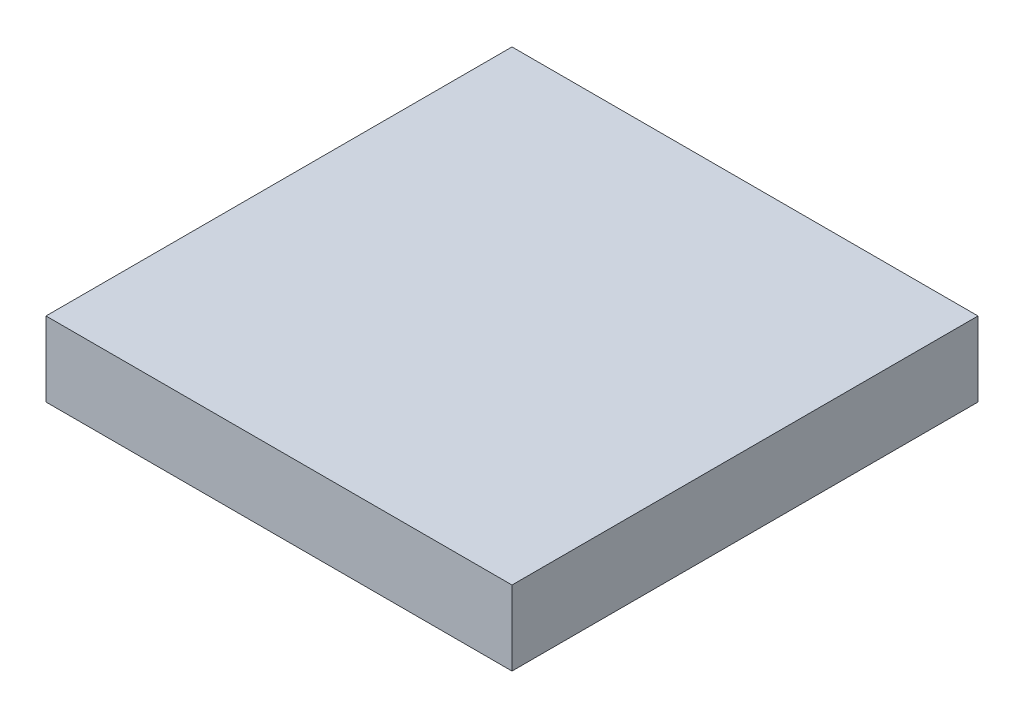
ISO-10303-21;
HEADER;
FILE_DESCRIPTION(('STEP AP214'),'2;1');
FILE_NAME('part.step','',(''),(''),'','','');
FILE_SCHEMA(('AUTOMOTIVE_DESIGN { 1 0 10303 214 1 1 1 1 }'));
ENDSEC;
DATA;
#1=APPLICATION_CONTEXT('core data for automotive mechanical design processes');
#2=APPLICATION_PROTOCOL_DEFINITION('international standard','automotive_design',2000,#1);
#3=PRODUCT_CONTEXT('',#1,'mechanical');
#4=PRODUCT('Part','Part','',(#3));
#5=PRODUCT_RELATED_PRODUCT_CATEGORY('part','',(#4));
#6=PRODUCT_DEFINITION_FORMATION('','',#4);
#7=PRODUCT_DEFINITION_CONTEXT('part definition',#1,'design');
#8=PRODUCT_DEFINITION('design','',#6,#7);
#9=PRODUCT_DEFINITION_SHAPE('','',#8);
#10=(LENGTH_UNIT() NAMED_UNIT(*) SI_UNIT(.MILLI.,.METRE.));
#11=(NAMED_UNIT(*) PLANE_ANGLE_UNIT() SI_UNIT($,.RADIAN.));
#12=(NAMED_UNIT(*) SI_UNIT($,.STERADIAN.) SOLID_ANGLE_UNIT());
#13=UNCERTAINTY_MEASURE_WITH_UNIT(LENGTH_MEASURE(1.E-05),#10,'distance_accuracy_value','');
#14=(GEOMETRIC_REPRESENTATION_CONTEXT(3) GLOBAL_UNCERTAINTY_ASSIGNED_CONTEXT((#13)) GLOBAL_UNIT_ASSIGNED_CONTEXT((#10,
#11,#12)) REPRESENTATION_CONTEXT('',''));
#15=CARTESIAN_POINT('',(0.,0.,0.));
#16=DIRECTION('',(0.,0.,1.));
#17=DIRECTION('',(1.,0.,0.));
#18=AXIS2_PLACEMENT_3D('',#15,#16,#17);
#19=CARTESIAN_POINT('',(-1.25,0.4,-1.25));
#20=DIRECTION('',(1.,0.,0.));
#21=DIRECTION('',(0.,0.,-1.));
#22=AXIS2_PLACEMENT_3D('',#19,#20,#21);
#23=PLANE('',#22);
#24=DIRECTION('',(0.,0.,1.));
#25=VECTOR('',#24,1.);
#26=CARTESIAN_POINT('',(-1.25,0.,-1.25));
#27=LINE('',#26,#25);
#28=CARTESIAN_POINT('',(-1.25,0.,-1.25));
#29=VERTEX_POINT('',#28);
#30=CARTESIAN_POINT('',(-1.25,0.,1.25));
#31=VERTEX_POINT('',#30);
#32=EDGE_CURVE('E111',#29,#31,#27,.T.);
#33=ORIENTED_EDGE('',*,*,#32,.T.);
#34=DIRECTION('',(0.,-1.,0.));
#35=VECTOR('',#34,1.);
#36=CARTESIAN_POINT('',(-1.25,0.4,1.25));
#37=LINE('',#36,#35);
#38=CARTESIAN_POINT('',(-1.25,0.4,1.25));
#39=VERTEX_POINT('',#38);
#40=EDGE_CURVE('E11',#39,#31,#37,.T.);
#41=ORIENTED_EDGE('',*,*,#40,.F.);
#42=DIRECTION('',(0.,0.,1.));
#43=VECTOR('',#42,1.);
#44=CARTESIAN_POINT('',(-1.25,0.4,-1.25));
#45=LINE('',#44,#43);
#46=CARTESIAN_POINT('',(-1.25,0.4,-1.25));
#47=VERTEX_POINT('',#46);
#48=EDGE_CURVE('E93',#47,#39,#45,.T.);
#49=ORIENTED_EDGE('',*,*,#48,.F.);
#50=DIRECTION('',(0.,-1.,0.));
#51=VECTOR('',#50,1.);
#52=CARTESIAN_POINT('',(-1.25,0.4,-1.25));
#53=LINE('',#52,#51);
#54=EDGE_CURVE('E107',#47,#29,#53,.T.);
#55=ORIENTED_EDGE('',*,*,#54,.T.);
#56=EDGE_LOOP('',(#33,#41,#49,#55));
#57=FACE_BOUND('',#56,.T.);
#58=ADVANCED_FACE('F41',(#57),#23,.F.);
#59=CARTESIAN_POINT('',(-1.25,0.4,1.25));
#60=DIRECTION('',(0.,0.,-1.));
#61=DIRECTION('',(-1.,0.,0.));
#62=AXIS2_PLACEMENT_3D('',#59,#60,#61);
#63=PLANE('',#62);
#64=DIRECTION('',(1.,0.,0.));
#65=VECTOR('',#64,1.);
#66=CARTESIAN_POINT('',(-1.25,0.,1.25));
#67=LINE('',#66,#65);
#68=CARTESIAN_POINT('',(1.25,0.,1.25));
#69=VERTEX_POINT('',#68);
#70=EDGE_CURVE('E98',#31,#69,#67,.T.);
#71=ORIENTED_EDGE('',*,*,#70,.T.);
#72=DIRECTION('',(0.,-1.,0.));
#73=VECTOR('',#72,1.);
#74=CARTESIAN_POINT('',(1.25,0.4,1.25));
#75=LINE('',#74,#73);
#76=CARTESIAN_POINT('',(1.25,0.4,1.25));
#77=VERTEX_POINT('',#76);
#78=EDGE_CURVE('E50',#77,#69,#75,.T.);
#79=ORIENTED_EDGE('',*,*,#78,.F.);
#80=DIRECTION('',(1.,0.,0.));
#81=VECTOR('',#80,1.);
#82=CARTESIAN_POINT('',(-1.25,0.4,1.25));
#83=LINE('',#82,#81);
#84=EDGE_CURVE('E88',#39,#77,#83,.T.);
#85=ORIENTED_EDGE('',*,*,#84,.F.);
#86=ORIENTED_EDGE('',*,*,#40,.T.);
#87=EDGE_LOOP('',(#71,#79,#85,#86));
#88=FACE_BOUND('',#87,.T.);
#89=ADVANCED_FACE('F97',(#88),#63,.F.);
#90=CARTESIAN_POINT('',(1.25,0.4,-1.25));
#91=DIRECTION('',(-1.,0.,0.));
#92=DIRECTION('',(0.,0.,1.));
#93=AXIS2_PLACEMENT_3D('',#90,#91,#92);
#94=PLANE('',#93);
#95=DIRECTION('',(0.,0.,-1.));
#96=VECTOR('',#95,1.);
#97=CARTESIAN_POINT('',(1.25,0.,-1.25));
#98=LINE('',#97,#96);
#99=CARTESIAN_POINT('',(1.25,0.,-1.25));
#100=VERTEX_POINT('',#99);
#101=EDGE_CURVE('E75',#69,#100,#98,.T.);
#102=ORIENTED_EDGE('',*,*,#101,.T.);
#103=DIRECTION('',(0.,-1.,0.));
#104=VECTOR('',#103,1.);
#105=CARTESIAN_POINT('',(1.25,0.4,-1.25));
#106=LINE('',#105,#104);
#107=CARTESIAN_POINT('',(1.25,0.4,-1.25));
#108=VERTEX_POINT('',#107);
#109=EDGE_CURVE('E100',#108,#100,#106,.T.);
#110=ORIENTED_EDGE('',*,*,#109,.F.);
#111=DIRECTION('',(0.,0.,-1.));
#112=VECTOR('',#111,1.);
#113=CARTESIAN_POINT('',(1.25,0.4,-1.25));
#114=LINE('',#113,#112);
#115=EDGE_CURVE('E91',#77,#108,#114,.T.);
#116=ORIENTED_EDGE('',*,*,#115,.F.);
#117=ORIENTED_EDGE('',*,*,#78,.T.);
#118=EDGE_LOOP('',(#102,#110,#116,#117));
#119=FACE_BOUND('',#118,.T.);
#120=ADVANCED_FACE('F101',(#119),#94,.F.);
#121=CARTESIAN_POINT('',(-1.25,0.4,-1.25));
#122=DIRECTION('',(0.,0.,1.));
#123=DIRECTION('',(1.,0.,0.));
#124=AXIS2_PLACEMENT_3D('',#121,#122,#123);
#125=PLANE('',#124);
#126=DIRECTION('',(-1.,0.,0.));
#127=VECTOR('',#126,1.);
#128=CARTESIAN_POINT('',(-1.25,0.,-1.25));
#129=LINE('',#128,#127);
#130=EDGE_CURVE('E81',#100,#29,#129,.T.);
#131=ORIENTED_EDGE('',*,*,#130,.T.);
#132=ORIENTED_EDGE('',*,*,#54,.F.);
#133=DIRECTION('',(-1.,0.,0.));
#134=VECTOR('',#133,1.);
#135=CARTESIAN_POINT('',(-1.25,0.4,-1.25));
#136=LINE('',#135,#134);
#137=EDGE_CURVE('E58',#108,#47,#136,.T.);
#138=ORIENTED_EDGE('',*,*,#137,.F.);
#139=ORIENTED_EDGE('',*,*,#109,.T.);
#140=EDGE_LOOP('',(#131,#132,#138,#139));
#141=FACE_BOUND('',#140,.T.);
#142=ADVANCED_FACE('F123',(#141),#125,.F.);
#143=CARTESIAN_POINT('',(0.,0.4,0.));
#144=DIRECTION('',(0.,1.,0.));
#145=DIRECTION('',(0.,0.,1.));
#146=AXIS2_PLACEMENT_3D('',#143,#144,#145);
#147=PLANE('',#146);
#148=ORIENTED_EDGE('',*,*,#48,.T.);
#149=ORIENTED_EDGE('',*,*,#84,.T.);
#150=ORIENTED_EDGE('',*,*,#115,.T.);
#151=ORIENTED_EDGE('',*,*,#137,.T.);
#152=EDGE_LOOP('',(#148,#149,#150,#151));
#153=FACE_BOUND('',#152,.T.);
#154=ADVANCED_FACE('F89',(#153),#147,.T.);
#155=CARTESIAN_POINT('',(0.,0.,0.));
#156=DIRECTION('',(0.,1.,0.));
#157=DIRECTION('',(0.,0.,1.));
#158=AXIS2_PLACEMENT_3D('',#155,#156,#157);
#159=PLANE('',#158);
#160=ORIENTED_EDGE('',*,*,#32,.F.);
#161=ORIENTED_EDGE('',*,*,#130,.F.);
#162=ORIENTED_EDGE('',*,*,#101,.F.);
#163=ORIENTED_EDGE('',*,*,#70,.F.);
#164=EDGE_LOOP('',(#160,#161,#162,#163));
#165=FACE_BOUND('',#164,.T.);
#166=ADVANCED_FACE('F126',(#165),#159,.F.);
#167=CLOSED_SHELL('',(#58,#89,#120,#142,#154,#166));
#168=MANIFOLD_SOLID_BREP('B2',#167);
#169=ADVANCED_BREP_SHAPE_REPRESENTATION('',(#18,#168),#14);
#170=SHAPE_DEFINITION_REPRESENTATION(#9,#169);
ENDSEC;
END-ISO-10303-21;
